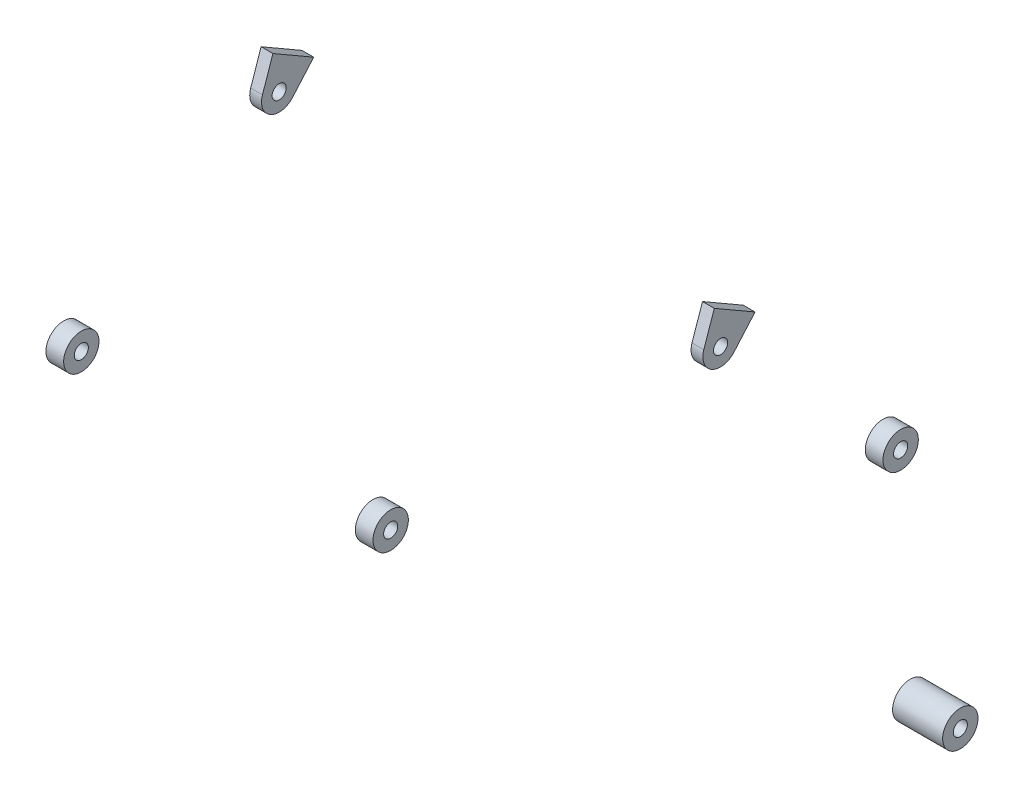
ISO-10303-21;
HEADER;
FILE_DESCRIPTION(('STEP AP214'),'2;1');
FILE_NAME('part.step','',(''),(''),'','','');
FILE_SCHEMA(('AUTOMOTIVE_DESIGN { 1 0 10303 214 1 1 1 1 }'));
ENDSEC;
DATA;
#1=APPLICATION_CONTEXT('core data for automotive mechanical design processes');
#2=APPLICATION_PROTOCOL_DEFINITION('international standard','automotive_design',2000,#1);
#3=PRODUCT_CONTEXT('',#1,'mechanical');
#4=PRODUCT('Part','Part','',(#3));
#5=PRODUCT_RELATED_PRODUCT_CATEGORY('part','',(#4));
#6=PRODUCT_DEFINITION_FORMATION('','',#4);
#7=PRODUCT_DEFINITION_CONTEXT('part definition',#1,'design');
#8=PRODUCT_DEFINITION('design','',#6,#7);
#9=PRODUCT_DEFINITION_SHAPE('','',#8);
#10=(LENGTH_UNIT() NAMED_UNIT(*) SI_UNIT(.MILLI.,.METRE.));
#11=(NAMED_UNIT(*) PLANE_ANGLE_UNIT() SI_UNIT($,.RADIAN.));
#12=(NAMED_UNIT(*) SI_UNIT($,.STERADIAN.) SOLID_ANGLE_UNIT());
#13=UNCERTAINTY_MEASURE_WITH_UNIT(LENGTH_MEASURE(1.E-05),#10,'distance_accuracy_value','');
#14=(GEOMETRIC_REPRESENTATION_CONTEXT(3) GLOBAL_UNCERTAINTY_ASSIGNED_CONTEXT((#13)) GLOBAL_UNIT_ASSIGNED_CONTEXT((#10,
#11,#12)) REPRESENTATION_CONTEXT('',''));
#15=CARTESIAN_POINT('',(0.,0.,0.));
#16=DIRECTION('',(0.,0.,1.));
#17=DIRECTION('',(1.,0.,0.));
#18=AXIS2_PLACEMENT_3D('',#15,#16,#17);
#19=CARTESIAN_POINT('',(-374.5,0.,0.));
#20=DIRECTION('',(-1.,0.,0.));
#21=DIRECTION('',(0.,0.,-1.));
#22=AXIS2_PLACEMENT_3D('',#19,#20,#21);
#23=PLANE('',#22);
#24=DIRECTION('',(0.,-0.946148298154616,0.323733529154957));
#25=VECTOR('',#24,1.);
#26=CARTESIAN_POINT('',(-374.5,4.85600293732436,14.1922244723192));
#27=LINE('',#26,#25);
#28=CARTESIAN_POINT('',(-374.5,30.7846096908265,5.32050807568877));
#29=VERTEX_POINT('',#28);
#30=CARTESIAN_POINT('',(-374.5,4.85600293732436,14.1922244723192));
#31=VERTEX_POINT('',#30);
#32=EDGE_CURVE('E102',#29,#31,#27,.T.);
#33=ORIENTED_EDGE('',*,*,#32,.F.);
#34=DIRECTION('',(0.,0.5,0.866025403784439));
#35=VECTOR('',#34,1.);
#36=CARTESIAN_POINT('',(-374.5,30.7846096908265,5.32050807568877));
#37=LINE('',#36,#35);
#38=CARTESIAN_POINT('',(-374.5,10.7846096908265,-29.3205080756888));
#39=VERTEX_POINT('',#38);
#40=EDGE_CURVE('E105',#39,#29,#37,.T.);
#41=ORIENTED_EDGE('',*,*,#40,.F.);
#42=DIRECTION('',(0.,0.753435609382291,-0.657521697371832));
#43=VECTOR('',#42,1.);
#44=CARTESIAN_POINT('',(-374.5,-9.86282546057748,-11.3015341407344));
#45=LINE('',#44,#43);
#46=CARTESIAN_POINT('',(-374.5,-9.86282546057748,-11.3015341407344));
#47=VERTEX_POINT('',#46);
#48=EDGE_CURVE('E93',#47,#39,#45,.T.);
#49=ORIENTED_EDGE('',*,*,#48,.F.);
#50=CARTESIAN_POINT('',(-374.5,0.,0.));
#51=DIRECTION('',(1.,0.,0.));
#52=DIRECTION('',(0.,0.,-1.));
#53=AXIS2_PLACEMENT_3D('',#50,#51,#52);
#54=CIRCLE('',#53,15.);
#55=EDGE_CURVE('E98',#31,#47,#54,.T.);
#56=ORIENTED_EDGE('',*,*,#55,.F.);
#57=EDGE_LOOP('',(#33,#41,#49,#56));
#58=FACE_BOUND('',#57,.T.);
#59=CARTESIAN_POINT('',(-374.5,0.,0.));
#60=DIRECTION('',(1.,0.,0.));
#61=DIRECTION('',(0.,0.,-1.));
#62=AXIS2_PLACEMENT_3D('',#59,#60,#61);
#63=CIRCLE('',#62,6.);
#64=CARTESIAN_POINT('',(-374.5,0.,-6.));
#65=VERTEX_POINT('',#64);
#66=EDGE_CURVE('E114',#65,#65,#63,.T.);
#67=ORIENTED_EDGE('',*,*,#66,.T.);
#68=EDGE_LOOP('',(#67));
#69=FACE_BOUND('',#68,.T.);
#70=ADVANCED_FACE('F46',(#58,#69),#23,.T.);
#71=CARTESIAN_POINT('',(-364.5,0.,0.));
#72=DIRECTION('',(-1.,0.,0.));
#73=DIRECTION('',(0.,0.,-1.));
#74=AXIS2_PLACEMENT_3D('',#71,#72,#73);
#75=PLANE('',#74);
#76=DIRECTION('',(0.,-0.946148298154616,0.323733529154957));
#77=VECTOR('',#76,1.);
#78=CARTESIAN_POINT('',(-364.5,4.85600293732436,14.1922244723192));
#79=LINE('',#78,#77);
#80=CARTESIAN_POINT('',(-364.5,30.7846096908265,5.32050807568877));
#81=VERTEX_POINT('',#80);
#82=CARTESIAN_POINT('',(-364.5,4.85600293732436,14.1922244723192));
#83=VERTEX_POINT('',#82);
#84=EDGE_CURVE('E110',#81,#83,#79,.T.);
#85=ORIENTED_EDGE('',*,*,#84,.T.);
#86=CARTESIAN_POINT('',(-364.5,0.,0.));
#87=DIRECTION('',(1.,0.,0.));
#88=DIRECTION('',(0.,0.,-1.));
#89=AXIS2_PLACEMENT_3D('',#86,#87,#88);
#90=CIRCLE('',#89,15.);
#91=CARTESIAN_POINT('',(-364.5,-9.86282546057748,-11.3015341407344));
#92=VERTEX_POINT('',#91);
#93=EDGE_CURVE('E113',#83,#92,#90,.T.);
#94=ORIENTED_EDGE('',*,*,#93,.T.);
#95=DIRECTION('',(0.,0.753435609382291,-0.657521697371832));
#96=VECTOR('',#95,1.);
#97=CARTESIAN_POINT('',(-364.5,-9.86282546057748,-11.3015341407344));
#98=LINE('',#97,#96);
#99=CARTESIAN_POINT('',(-364.5,10.7846096908265,-29.3205080756888));
#100=VERTEX_POINT('',#99);
#101=EDGE_CURVE('E96',#92,#100,#98,.T.);
#102=ORIENTED_EDGE('',*,*,#101,.T.);
#103=DIRECTION('',(0.,0.5,0.866025403784439));
#104=VECTOR('',#103,1.);
#105=CARTESIAN_POINT('',(-364.5,30.7846096908265,5.32050807568877));
#106=LINE('',#105,#104);
#107=EDGE_CURVE('E117',#100,#81,#106,.T.);
#108=ORIENTED_EDGE('',*,*,#107,.T.);
#109=EDGE_LOOP('',(#85,#94,#102,#108));
#110=FACE_BOUND('',#109,.T.);
#111=CARTESIAN_POINT('',(-364.5,0.,0.));
#112=DIRECTION('',(1.,0.,0.));
#113=DIRECTION('',(0.,0.,-1.));
#114=AXIS2_PLACEMENT_3D('',#111,#112,#113);
#115=CIRCLE('',#114,6.);
#116=CARTESIAN_POINT('',(-364.5,0.,-6.));
#117=VERTEX_POINT('',#116);
#118=EDGE_CURVE('E122',#117,#117,#115,.T.);
#119=ORIENTED_EDGE('',*,*,#118,.F.);
#120=EDGE_LOOP('',(#119));
#121=FACE_BOUND('',#120,.T.);
#122=ADVANCED_FACE('F135',(#110,#121),#75,.F.);
#123=CARTESIAN_POINT('',(-374.5,4.85600293732436,14.1922244723192));
#124=DIRECTION('',(0.,-0.323733529154957,-0.946148298154616));
#125=DIRECTION('',(0.,0.946148298154616,-0.323733529154957));
#126=AXIS2_PLACEMENT_3D('',#123,#124,#125);
#127=PLANE('',#126);
#128=ORIENTED_EDGE('',*,*,#84,.F.);
#129=DIRECTION('',(1.,0.,0.));
#130=VECTOR('',#129,1.);
#131=CARTESIAN_POINT('',(-374.5,30.7846096908265,5.32050807568877));
#132=LINE('',#131,#130);
#133=EDGE_CURVE('E63',#29,#81,#132,.T.);
#134=ORIENTED_EDGE('',*,*,#133,.F.);
#135=ORIENTED_EDGE('',*,*,#32,.T.);
#136=DIRECTION('',(1.,0.,0.));
#137=VECTOR('',#136,1.);
#138=CARTESIAN_POINT('',(-374.5,4.85600293732436,14.1922244723192));
#139=LINE('',#138,#137);
#140=EDGE_CURVE('E12',#31,#83,#139,.T.);
#141=ORIENTED_EDGE('',*,*,#140,.T.);
#142=EDGE_LOOP('',(#128,#134,#135,#141));
#143=FACE_BOUND('',#142,.T.);
#144=ADVANCED_FACE('F48',(#143),#127,.F.);
#145=CARTESIAN_POINT('',(-374.5,0.,0.));
#146=DIRECTION('',(1.,0.,0.));
#147=DIRECTION('',(0.,0.,1.));
#148=AXIS2_PLACEMENT_3D('',#145,#146,#147);
#149=CYLINDRICAL_SURFACE('',#148,15.);
#150=ORIENTED_EDGE('',*,*,#93,.F.);
#151=ORIENTED_EDGE('',*,*,#140,.F.);
#152=ORIENTED_EDGE('',*,*,#55,.T.);
#153=DIRECTION('',(1.,0.,0.));
#154=VECTOR('',#153,1.);
#155=CARTESIAN_POINT('',(-374.5,-9.86282546057748,-11.3015341407344));
#156=LINE('',#155,#154);
#157=EDGE_CURVE('E55',#47,#92,#156,.T.);
#158=ORIENTED_EDGE('',*,*,#157,.T.);
#159=EDGE_LOOP('',(#150,#151,#152,#158));
#160=FACE_BOUND('',#159,.T.);
#161=ADVANCED_FACE('F99',(#160),#149,.T.);
#162=CARTESIAN_POINT('',(-374.5,-9.86282546057748,-11.3015341407344));
#163=DIRECTION('',(0.,0.657521697371832,0.753435609382291));
#164=DIRECTION('',(0.,-0.753435609382291,0.657521697371832));
#165=AXIS2_PLACEMENT_3D('',#162,#163,#164);
#166=PLANE('',#165);
#167=ORIENTED_EDGE('',*,*,#101,.F.);
#168=ORIENTED_EDGE('',*,*,#157,.F.);
#169=ORIENTED_EDGE('',*,*,#48,.T.);
#170=DIRECTION('',(1.,0.,0.));
#171=VECTOR('',#170,1.);
#172=CARTESIAN_POINT('',(-374.5,10.7846096908265,-29.3205080756888));
#173=LINE('',#172,#171);
#174=EDGE_CURVE('E79',#39,#100,#173,.T.);
#175=ORIENTED_EDGE('',*,*,#174,.T.);
#176=EDGE_LOOP('',(#167,#168,#169,#175));
#177=FACE_BOUND('',#176,.T.);
#178=ADVANCED_FACE('F91',(#177),#166,.F.);
#179=CARTESIAN_POINT('',(-374.5,30.7846096908265,5.32050807568877));
#180=DIRECTION('',(0.,-0.866025403784439,0.5));
#181=DIRECTION('',(0.,-0.5,-0.866025403784439));
#182=AXIS2_PLACEMENT_3D('',#179,#180,#181);
#183=PLANE('',#182);
#184=ORIENTED_EDGE('',*,*,#107,.F.);
#185=ORIENTED_EDGE('',*,*,#174,.F.);
#186=ORIENTED_EDGE('',*,*,#40,.T.);
#187=ORIENTED_EDGE('',*,*,#133,.T.);
#188=EDGE_LOOP('',(#184,#185,#186,#187));
#189=FACE_BOUND('',#188,.T.);
#190=ADVANCED_FACE('F131',(#189),#183,.F.);
#191=CARTESIAN_POINT('',(-374.5,0.,0.));
#192=DIRECTION('',(1.,0.,0.));
#193=DIRECTION('',(0.,0.,1.));
#194=AXIS2_PLACEMENT_3D('',#191,#192,#193);
#195=CYLINDRICAL_SURFACE('',#194,6.);
#196=ORIENTED_EDGE('',*,*,#66,.F.);
#197=EDGE_LOOP('',(#196));
#198=FACE_BOUND('',#197,.T.);
#199=ORIENTED_EDGE('',*,*,#118,.T.);
#200=EDGE_LOOP('',(#199));
#201=FACE_BOUND('',#200,.T.);
#202=ADVANCED_FACE('F128',(#198,#201),#195,.F.);
#203=CLOSED_SHELL('',(#70,#122,#144,#161,#178,#190,#202));
#204=MANIFOLD_SOLID_BREP('B2',#203);
#205=CARTESIAN_POINT('',(-306.,-48.3944880943371,226.385122130601));
#206=DIRECTION('',(-1.,0.,0.));
#207=DIRECTION('',(0.,0.,-1.));
#208=AXIS2_PLACEMENT_3D('',#205,#206,#207);
#209=CYLINDRICAL_SURFACE('',#208,15.);
#210=CARTESIAN_POINT('',(-306.,-48.3944880943371,226.385122130601));
#211=DIRECTION('',(1.,0.,0.));
#212=DIRECTION('',(0.,0.,-1.));
#213=AXIS2_PLACEMENT_3D('',#210,#211,#212);
#214=CIRCLE('',#213,15.);
#215=CARTESIAN_POINT('',(-306.,-48.3944880943371,211.385122130601));
#216=VERTEX_POINT('',#215);
#217=EDGE_CURVE('E45',#216,#216,#214,.T.);
#218=ORIENTED_EDGE('',*,*,#217,.F.);
#219=EDGE_LOOP('',(#218));
#220=FACE_BOUND('',#219,.T.);
#221=CARTESIAN_POINT('',(-321.,-48.3944880943371,226.385122130601));
#222=DIRECTION('',(1.,0.,0.));
#223=DIRECTION('',(0.,0.,-1.));
#224=AXIS2_PLACEMENT_3D('',#221,#222,#223);
#225=CIRCLE('',#224,15.);
#226=CARTESIAN_POINT('',(-321.,-48.3944880943371,211.385122130601));
#227=VERTEX_POINT('',#226);
#228=EDGE_CURVE('E202',#227,#227,#225,.T.);
#229=ORIENTED_EDGE('',*,*,#228,.T.);
#230=EDGE_LOOP('',(#229));
#231=FACE_BOUND('',#230,.T.);
#232=ADVANCED_FACE('F199',(#220,#231),#209,.T.);
#233=CARTESIAN_POINT('',(-306.,-48.3944880943371,226.385122130601));
#234=DIRECTION('',(-1.,0.,0.));
#235=DIRECTION('',(0.,0.,-1.));
#236=AXIS2_PLACEMENT_3D('',#233,#234,#235);
#237=PLANE('',#236);
#238=CARTESIAN_POINT('',(-306.,-48.3944880943371,226.385122130601));
#239=DIRECTION('',(1.,0.,0.));
#240=DIRECTION('',(0.,0.,-1.));
#241=AXIS2_PLACEMENT_3D('',#238,#239,#240);
#242=CIRCLE('',#241,6.00000000000002);
#243=CARTESIAN_POINT('',(-306.,-48.3944880943371,220.385122130601));
#244=VERTEX_POINT('',#243);
#245=EDGE_CURVE('E209',#244,#244,#242,.T.);
#246=ORIENTED_EDGE('',*,*,#245,.F.);
#247=EDGE_LOOP('',(#246));
#248=FACE_BOUND('',#247,.T.);
#249=ORIENTED_EDGE('',*,*,#217,.T.);
#250=EDGE_LOOP('',(#249));
#251=FACE_BOUND('',#250,.T.);
#252=ADVANCED_FACE('F220',(#248,#251),#237,.F.);
#253=CARTESIAN_POINT('',(-321.,-48.3944880943371,226.385122130601));
#254=DIRECTION('',(-1.,0.,0.));
#255=DIRECTION('',(0.,0.,-1.));
#256=AXIS2_PLACEMENT_3D('',#253,#254,#255);
#257=PLANE('',#256);
#258=CARTESIAN_POINT('',(-321.,-48.3944880943371,226.385122130601));
#259=DIRECTION('',(1.,0.,0.));
#260=DIRECTION('',(0.,0.,-1.));
#261=AXIS2_PLACEMENT_3D('',#258,#259,#260);
#262=CIRCLE('',#261,6.00000000000002);
#263=CARTESIAN_POINT('',(-321.,-48.3944880943371,220.385122130601));
#264=VERTEX_POINT('',#263);
#265=EDGE_CURVE('E211',#264,#264,#262,.T.);
#266=ORIENTED_EDGE('',*,*,#265,.T.);
#267=EDGE_LOOP('',(#266));
#268=FACE_BOUND('',#267,.T.);
#269=ORIENTED_EDGE('',*,*,#228,.F.);
#270=EDGE_LOOP('',(#269));
#271=FACE_BOUND('',#270,.T.);
#272=ADVANCED_FACE('F222',(#268,#271),#257,.T.);
#273=CARTESIAN_POINT('',(-306.,-48.3944880943371,226.385122130601));
#274=DIRECTION('',(-1.,0.,0.));
#275=DIRECTION('',(0.,0.,-1.));
#276=AXIS2_PLACEMENT_3D('',#273,#274,#275);
#277=CYLINDRICAL_SURFACE('',#276,6.00000000000002);
#278=ORIENTED_EDGE('',*,*,#245,.T.);
#279=EDGE_LOOP('',(#278));
#280=FACE_BOUND('',#279,.T.);
#281=ORIENTED_EDGE('',*,*,#265,.F.);
#282=EDGE_LOOP('',(#281));
#283=FACE_BOUND('',#282,.T.);
#284=ADVANCED_FACE('F217',(#280,#283),#277,.F.);
#285=CLOSED_SHELL('',(#232,#252,#272,#284));
#286=MANIFOLD_SOLID_BREP('B6',#285);
#287=CARTESIAN_POINT('',(-36.5,-198.760014478319,-199.340679853808));
#288=DIRECTION('',(-1.,0.,0.));
#289=DIRECTION('',(0.,0.,1.));
#290=AXIS2_PLACEMENT_3D('',#287,#288,#289);
#291=CYLINDRICAL_SURFACE('',#290,15.);
#292=CARTESIAN_POINT('',(-36.5,-198.760014478319,-199.340679853808));
#293=DIRECTION('',(1.,0.,0.));
#294=DIRECTION('',(0.,0.,-1.));
#295=AXIS2_PLACEMENT_3D('',#292,#293,#294);
#296=CIRCLE('',#295,15.);
#297=CARTESIAN_POINT('',(-36.5,-198.760014478319,-214.340679853808));
#298=VERTEX_POINT('',#297);
#299=EDGE_CURVE('E276',#298,#298,#296,.T.);
#300=ORIENTED_EDGE('',*,*,#299,.F.);
#301=EDGE_LOOP('',(#300));
#302=FACE_BOUND('',#301,.T.);
#303=CARTESIAN_POINT('',(-51.5,-198.760014478319,-199.340679853808));
#304=DIRECTION('',(1.,0.,0.));
#305=DIRECTION('',(0.,0.,-1.));
#306=AXIS2_PLACEMENT_3D('',#303,#304,#305);
#307=CIRCLE('',#306,15.);
#308=CARTESIAN_POINT('',(-51.5,-198.760014478319,-214.340679853808));
#309=VERTEX_POINT('',#308);
#310=EDGE_CURVE('E282',#309,#309,#307,.T.);
#311=ORIENTED_EDGE('',*,*,#310,.T.);
#312=EDGE_LOOP('',(#311));
#313=FACE_BOUND('',#312,.T.);
#314=ADVANCED_FACE('F269',(#302,#313),#291,.T.);
#315=CARTESIAN_POINT('',(-36.5,-198.760014478319,-199.340679853808));
#316=DIRECTION('',(-1.,0.,0.));
#317=DIRECTION('',(0.,0.,1.));
#318=AXIS2_PLACEMENT_3D('',#315,#316,#317);
#319=CYLINDRICAL_SURFACE('',#318,6.00000000000002);
#320=CARTESIAN_POINT('',(-36.5,-198.760014478319,-199.340679853808));
#321=DIRECTION('',(1.,0.,0.));
#322=DIRECTION('',(0.,0.,-1.));
#323=AXIS2_PLACEMENT_3D('',#320,#321,#322);
#324=CIRCLE('',#323,6.00000000000002);
#325=CARTESIAN_POINT('',(-36.5,-198.760014478319,-205.340679853808));
#326=VERTEX_POINT('',#325);
#327=EDGE_CURVE('E198',#326,#326,#324,.T.);
#328=ORIENTED_EDGE('',*,*,#327,.T.);
#329=EDGE_LOOP('',(#328));
#330=FACE_BOUND('',#329,.T.);
#331=CARTESIAN_POINT('',(-51.5,-198.760014478319,-199.340679853808));
#332=DIRECTION('',(1.,0.,0.));
#333=DIRECTION('',(0.,0.,-1.));
#334=AXIS2_PLACEMENT_3D('',#331,#332,#333);
#335=CIRCLE('',#334,6.00000000000002);
#336=CARTESIAN_POINT('',(-51.5,-198.760014478319,-205.340679853808));
#337=VERTEX_POINT('',#336);
#338=EDGE_CURVE('E272',#337,#337,#335,.T.);
#339=ORIENTED_EDGE('',*,*,#338,.F.);
#340=EDGE_LOOP('',(#339));
#341=FACE_BOUND('',#340,.T.);
#342=ADVANCED_FACE('F291',(#330,#341),#319,.F.);
#343=CARTESIAN_POINT('',(-36.5,0.,0.));
#344=DIRECTION('',(1.,0.,0.));
#345=DIRECTION('',(0.,0.,-1.));
#346=AXIS2_PLACEMENT_3D('',#343,#344,#345);
#347=PLANE('',#346);
#348=ORIENTED_EDGE('',*,*,#299,.T.);
#349=EDGE_LOOP('',(#348));
#350=FACE_BOUND('',#349,.T.);
#351=ORIENTED_EDGE('',*,*,#327,.F.);
#352=EDGE_LOOP('',(#351));
#353=FACE_BOUND('',#352,.T.);
#354=ADVANCED_FACE('F293',(#350,#353),#347,.T.);
#355=CARTESIAN_POINT('',(-51.5,0.,0.));
#356=DIRECTION('',(1.,0.,0.));
#357=DIRECTION('',(0.,0.,-1.));
#358=AXIS2_PLACEMENT_3D('',#355,#356,#357);
#359=PLANE('',#358);
#360=ORIENTED_EDGE('',*,*,#310,.F.);
#361=EDGE_LOOP('',(#360));
#362=FACE_BOUND('',#361,.T.);
#363=ORIENTED_EDGE('',*,*,#338,.T.);
#364=EDGE_LOOP('',(#363));
#365=FACE_BOUND('',#364,.T.);
#366=ADVANCED_FACE('F289',(#362,#365),#359,.F.);
#367=CLOSED_SHELL('',(#314,#342,#354,#366));
#368=MANIFOLD_SOLID_BREP('B40',#367);
#369=CARTESIAN_POINT('',(-30.,-422.357745707924,-243.457119430366));
#370=DIRECTION('',(1.,0.,0.));
#371=DIRECTION('',(0.,0.,-1.));
#372=AXIS2_PLACEMENT_3D('',#369,#370,#371);
#373=PLANE('',#372);
#374=CARTESIAN_POINT('',(-30.,-422.357745707924,-243.457119430366));
#375=DIRECTION('',(1.,0.,0.));
#376=DIRECTION('',(0.,0.,-1.));
#377=AXIS2_PLACEMENT_3D('',#374,#375,#376);
#378=CIRCLE('',#377,15.0000000000001);
#379=CARTESIAN_POINT('',(-30.,-422.357745707924,-258.457119430366));
#380=VERTEX_POINT('',#379);
#381=EDGE_CURVE('E268',#380,#380,#378,.T.);
#382=ORIENTED_EDGE('',*,*,#381,.T.);
#383=EDGE_LOOP('',(#382));
#384=FACE_BOUND('',#383,.T.);
#385=CARTESIAN_POINT('',(-30.,-422.357745707924,-243.457119430366));
#386=DIRECTION('',(1.,0.,0.));
#387=DIRECTION('',(0.,0.,-1.));
#388=AXIS2_PLACEMENT_3D('',#385,#386,#387);
#389=CIRCLE('',#388,5.99999999999999);
#390=CARTESIAN_POINT('',(-30.,-422.357745707924,-249.457119430366));
#391=VERTEX_POINT('',#390);
#392=EDGE_CURVE('E362',#391,#391,#389,.T.);
#393=ORIENTED_EDGE('',*,*,#392,.F.);
#394=EDGE_LOOP('',(#393));
#395=FACE_BOUND('',#394,.T.);
#396=ADVANCED_FACE('F351',(#384,#395),#373,.T.);
#397=CARTESIAN_POINT('',(-72.5,-422.357745707924,-243.457119430366));
#398=DIRECTION('',(1.,0.,0.));
#399=DIRECTION('',(0.,0.,-1.));
#400=AXIS2_PLACEMENT_3D('',#397,#398,#399);
#401=PLANE('',#400);
#402=CARTESIAN_POINT('',(-72.5,-422.357745707924,-243.457119430366));
#403=DIRECTION('',(1.,0.,0.));
#404=DIRECTION('',(0.,0.,-1.));
#405=AXIS2_PLACEMENT_3D('',#402,#403,#404);
#406=CIRCLE('',#405,15.0000000000001);
#407=CARTESIAN_POINT('',(-72.5,-422.357745707924,-258.457119430366));
#408=VERTEX_POINT('',#407);
#409=EDGE_CURVE('E355',#408,#408,#406,.T.);
#410=ORIENTED_EDGE('',*,*,#409,.F.);
#411=EDGE_LOOP('',(#410));
#412=FACE_BOUND('',#411,.T.);
#413=CARTESIAN_POINT('',(-72.5,-422.357745707924,-243.457119430366));
#414=DIRECTION('',(1.,0.,0.));
#415=DIRECTION('',(0.,0.,-1.));
#416=AXIS2_PLACEMENT_3D('',#413,#414,#415);
#417=CIRCLE('',#416,5.99999999999999);
#418=CARTESIAN_POINT('',(-72.5,-422.357745707924,-249.457119430366));
#419=VERTEX_POINT('',#418);
#420=EDGE_CURVE('E364',#419,#419,#417,.T.);
#421=ORIENTED_EDGE('',*,*,#420,.T.);
#422=EDGE_LOOP('',(#421));
#423=FACE_BOUND('',#422,.T.);
#424=ADVANCED_FACE('F374',(#412,#423),#401,.F.);
#425=CARTESIAN_POINT('',(-30.,-422.357745707924,-243.457119430366));
#426=DIRECTION('',(-1.,0.,0.));
#427=DIRECTION('',(0.,0.,1.));
#428=AXIS2_PLACEMENT_3D('',#425,#426,#427);
#429=CYLINDRICAL_SURFACE('',#428,15.0000000000001);
#430=ORIENTED_EDGE('',*,*,#381,.F.);
#431=EDGE_LOOP('',(#430));
#432=FACE_BOUND('',#431,.T.);
#433=ORIENTED_EDGE('',*,*,#409,.T.);
#434=EDGE_LOOP('',(#433));
#435=FACE_BOUND('',#434,.T.);
#436=ADVANCED_FACE('F353',(#432,#435),#429,.T.);
#437=CARTESIAN_POINT('',(-30.,-422.357745707924,-243.457119430366));
#438=DIRECTION('',(-1.,0.,0.));
#439=DIRECTION('',(0.,0.,1.));
#440=AXIS2_PLACEMENT_3D('',#437,#438,#439);
#441=CYLINDRICAL_SURFACE('',#440,5.99999999999999);
#442=ORIENTED_EDGE('',*,*,#392,.T.);
#443=EDGE_LOOP('',(#442));
#444=FACE_BOUND('',#443,.T.);
#445=ORIENTED_EDGE('',*,*,#420,.F.);
#446=EDGE_LOOP('',(#445));
#447=FACE_BOUND('',#446,.T.);
#448=ADVANCED_FACE('F370',(#444,#447),#441,.F.);
#449=CLOSED_SHELL('',(#396,#424,#436,#448));
#450=MANIFOLD_SOLID_BREP('B193',#449);
#451=CARTESIAN_POINT('',(-58.5,-48.3944880943371,226.385122130601));
#452=DIRECTION('',(1.,0.,0.));
#453=DIRECTION('',(0.,0.,-1.));
#454=AXIS2_PLACEMENT_3D('',#451,#452,#453);
#455=CYLINDRICAL_SURFACE('',#454,15.);
#456=CARTESIAN_POINT('',(-58.5,-48.3944880943371,226.385122130601));
#457=DIRECTION('',(1.,0.,0.));
#458=DIRECTION('',(0.,0.,-1.));
#459=AXIS2_PLACEMENT_3D('',#456,#457,#458);
#460=CIRCLE('',#459,15.);
#461=CARTESIAN_POINT('',(-58.5,-48.3944880943371,211.385122130601));
#462=VERTEX_POINT('',#461);
#463=EDGE_CURVE('E350',#462,#462,#460,.T.);
#464=ORIENTED_EDGE('',*,*,#463,.T.);
#465=EDGE_LOOP('',(#464));
#466=FACE_BOUND('',#465,.T.);
#467=CARTESIAN_POINT('',(-43.5,-48.3944880943371,226.385122130601));
#468=DIRECTION('',(1.,0.,0.));
#469=DIRECTION('',(0.,0.,-1.));
#470=AXIS2_PLACEMENT_3D('',#467,#468,#469);
#471=CIRCLE('',#470,15.);
#472=CARTESIAN_POINT('',(-43.5,-48.3944880943371,211.385122130601));
#473=VERTEX_POINT('',#472);
#474=EDGE_CURVE('E425',#473,#473,#471,.T.);
#475=ORIENTED_EDGE('',*,*,#474,.F.);
#476=EDGE_LOOP('',(#475));
#477=FACE_BOUND('',#476,.T.);
#478=ADVANCED_FACE('F422',(#466,#477),#455,.T.);
#479=CARTESIAN_POINT('',(-58.5,-48.3944880943371,226.385122130601));
#480=DIRECTION('',(1.,0.,0.));
#481=DIRECTION('',(0.,0.,-1.));
#482=AXIS2_PLACEMENT_3D('',#479,#480,#481);
#483=PLANE('',#482);
#484=CARTESIAN_POINT('',(-58.5,-48.3944880943371,226.385122130601));
#485=DIRECTION('',(1.,0.,0.));
#486=DIRECTION('',(0.,0.,-1.));
#487=AXIS2_PLACEMENT_3D('',#484,#485,#486);
#488=CIRCLE('',#487,6.00000000000002);
#489=CARTESIAN_POINT('',(-58.5,-48.3944880943371,220.385122130601));
#490=VERTEX_POINT('',#489);
#491=EDGE_CURVE('E432',#490,#490,#488,.T.);
#492=ORIENTED_EDGE('',*,*,#491,.T.);
#493=EDGE_LOOP('',(#492));
#494=FACE_BOUND('',#493,.T.);
#495=ORIENTED_EDGE('',*,*,#463,.F.);
#496=EDGE_LOOP('',(#495));
#497=FACE_BOUND('',#496,.T.);
#498=ADVANCED_FACE('F440',(#494,#497),#483,.F.);
#499=CARTESIAN_POINT('',(-43.5,-48.3944880943371,226.385122130601));
#500=DIRECTION('',(1.,0.,0.));
#501=DIRECTION('',(0.,0.,-1.));
#502=AXIS2_PLACEMENT_3D('',#499,#500,#501);
#503=PLANE('',#502);
#504=CARTESIAN_POINT('',(-43.5,-48.3944880943371,226.385122130601));
#505=DIRECTION('',(1.,0.,0.));
#506=DIRECTION('',(0.,0.,-1.));
#507=AXIS2_PLACEMENT_3D('',#504,#505,#506);
#508=CIRCLE('',#507,6.00000000000002);
#509=CARTESIAN_POINT('',(-43.5,-48.3944880943371,220.385122130601));
#510=VERTEX_POINT('',#509);
#511=EDGE_CURVE('E434',#510,#510,#508,.T.);
#512=ORIENTED_EDGE('',*,*,#511,.F.);
#513=EDGE_LOOP('',(#512));
#514=FACE_BOUND('',#513,.T.);
#515=ORIENTED_EDGE('',*,*,#474,.T.);
#516=EDGE_LOOP('',(#515));
#517=FACE_BOUND('',#516,.T.);
#518=ADVANCED_FACE('F446',(#514,#517),#503,.T.);
#519=CARTESIAN_POINT('',(-58.5,-48.3944880943371,226.385122130601));
#520=DIRECTION('',(1.,0.,0.));
#521=DIRECTION('',(0.,0.,-1.));
#522=AXIS2_PLACEMENT_3D('',#519,#520,#521);
#523=CYLINDRICAL_SURFACE('',#522,6.00000000000002);
#524=ORIENTED_EDGE('',*,*,#491,.F.);
#525=EDGE_LOOP('',(#524));
#526=FACE_BOUND('',#525,.T.);
#527=ORIENTED_EDGE('',*,*,#511,.T.);
#528=EDGE_LOOP('',(#527));
#529=FACE_BOUND('',#528,.T.);
#530=ADVANCED_FACE('F443',(#526,#529),#523,.F.);
#531=CLOSED_SHELL('',(#478,#498,#518,#530));
#532=MANIFOLD_SOLID_BREP('B263',#531);
#533=CARTESIAN_POINT('',(10.,0.,0.));
#534=DIRECTION('',(1.,0.,0.));
#535=DIRECTION('',(0.,0.,-1.));
#536=AXIS2_PLACEMENT_3D('',#533,#534,#535);
#537=PLANE('',#536);
#538=DIRECTION('',(0.,-0.946148298154616,0.323733529154957));
#539=VECTOR('',#538,1.);
#540=CARTESIAN_POINT('',(10.,4.85600293732436,14.1922244723192));
#541=LINE('',#540,#539);
#542=CARTESIAN_POINT('',(10.,30.7846096908265,5.32050807568877));
#543=VERTEX_POINT('',#542);
#544=CARTESIAN_POINT('',(10.,4.85600293732436,14.1922244723192));
#545=VERTEX_POINT('',#544);
#546=EDGE_CURVE('E536',#543,#545,#541,.T.);
#547=ORIENTED_EDGE('',*,*,#546,.T.);
#548=CARTESIAN_POINT('',(10.,0.,0.));
#549=DIRECTION('',(1.,0.,0.));
#550=DIRECTION('',(0.,0.,-1.));
#551=AXIS2_PLACEMENT_3D('',#548,#549,#550);
#552=CIRCLE('',#551,15.);
#553=CARTESIAN_POINT('',(10.,-9.86282546057748,-11.3015341407344));
#554=VERTEX_POINT('',#553);
#555=EDGE_CURVE('E531',#545,#554,#552,.T.);
#556=ORIENTED_EDGE('',*,*,#555,.T.);
#557=DIRECTION('',(0.,0.753435609382291,-0.657521697371832));
#558=VECTOR('',#557,1.);
#559=CARTESIAN_POINT('',(10.,-9.86282546057748,-11.3015341407344));
#560=LINE('',#559,#558);
#561=CARTESIAN_POINT('',(10.,10.7846096908265,-29.3205080756888));
#562=VERTEX_POINT('',#561);
#563=EDGE_CURVE('E534',#554,#562,#560,.T.);
#564=ORIENTED_EDGE('',*,*,#563,.T.);
#565=DIRECTION('',(0.,0.5,0.866025403784439));
#566=VECTOR('',#565,1.);
#567=CARTESIAN_POINT('',(10.,30.7846096908265,5.32050807568877));
#568=LINE('',#567,#566);
#569=EDGE_CURVE('E501',#562,#543,#568,.T.);
#570=ORIENTED_EDGE('',*,*,#569,.T.);
#571=EDGE_LOOP('',(#547,#556,#564,#570));
#572=FACE_BOUND('',#571,.T.);
#573=CARTESIAN_POINT('',(10.,0.,0.));
#574=DIRECTION('',(1.,0.,0.));
#575=DIRECTION('',(0.,0.,-1.));
#576=AXIS2_PLACEMENT_3D('',#573,#574,#575);
#577=CIRCLE('',#576,6.);
#578=CARTESIAN_POINT('',(10.,0.,-6.));
#579=VERTEX_POINT('',#578);
#580=EDGE_CURVE('E551',#579,#579,#577,.T.);
#581=ORIENTED_EDGE('',*,*,#580,.F.);
#582=EDGE_LOOP('',(#581));
#583=FACE_BOUND('',#582,.T.);
#584=ADVANCED_FACE('F484',(#572,#583),#537,.T.);
#585=CARTESIAN_POINT('',(0.,0.,0.));
#586=DIRECTION('',(1.,0.,0.));
#587=DIRECTION('',(0.,0.,-1.));
#588=AXIS2_PLACEMENT_3D('',#585,#586,#587);
#589=PLANE('',#588);
#590=DIRECTION('',(0.,-0.946148298154616,0.323733529154957));
#591=VECTOR('',#590,1.);
#592=CARTESIAN_POINT('',(0.,4.85600293732436,14.1922244723192));
#593=LINE('',#592,#591);
#594=CARTESIAN_POINT('',(0.,30.7846096908265,5.32050807568877));
#595=VERTEX_POINT('',#594);
#596=CARTESIAN_POINT('',(0.,4.85600293732436,14.1922244723192));
#597=VERTEX_POINT('',#596);
#598=EDGE_CURVE('E548',#595,#597,#593,.T.);
#599=ORIENTED_EDGE('',*,*,#598,.F.);
#600=DIRECTION('',(0.,0.5,0.866025403784439));
#601=VECTOR('',#600,1.);
#602=CARTESIAN_POINT('',(0.,30.7846096908265,5.32050807568877));
#603=LINE('',#602,#601);
#604=CARTESIAN_POINT('',(0.,10.7846096908265,-29.3205080756888));
#605=VERTEX_POINT('',#604);
#606=EDGE_CURVE('E524',#605,#595,#603,.T.);
#607=ORIENTED_EDGE('',*,*,#606,.F.);
#608=DIRECTION('',(0.,0.753435609382291,-0.657521697371832));
#609=VECTOR('',#608,1.);
#610=CARTESIAN_POINT('',(0.,-9.86282546057748,-11.3015341407344));
#611=LINE('',#610,#609);
#612=CARTESIAN_POINT('',(0.,-9.86282546057748,-11.3015341407344));
#613=VERTEX_POINT('',#612);
#614=EDGE_CURVE('E518',#613,#605,#611,.T.);
#615=ORIENTED_EDGE('',*,*,#614,.F.);
#616=CARTESIAN_POINT('',(0.,0.,0.));
#617=DIRECTION('',(1.,0.,0.));
#618=DIRECTION('',(0.,0.,-1.));
#619=AXIS2_PLACEMENT_3D('',#616,#617,#618);
#620=CIRCLE('',#619,15.);
#621=EDGE_CURVE('E540',#597,#613,#620,.T.);
#622=ORIENTED_EDGE('',*,*,#621,.F.);
#623=EDGE_LOOP('',(#599,#607,#615,#622));
#624=FACE_BOUND('',#623,.T.);
#625=CARTESIAN_POINT('',(0.,0.,0.));
#626=DIRECTION('',(1.,0.,0.));
#627=DIRECTION('',(0.,0.,-1.));
#628=AXIS2_PLACEMENT_3D('',#625,#626,#627);
#629=CIRCLE('',#628,6.);
#630=CARTESIAN_POINT('',(0.,0.,-6.));
#631=VERTEX_POINT('',#630);
#632=EDGE_CURVE('E563',#631,#631,#629,.T.);
#633=ORIENTED_EDGE('',*,*,#632,.T.);
#634=EDGE_LOOP('',(#633));
#635=FACE_BOUND('',#634,.T.);
#636=ADVANCED_FACE('F559',(#624,#635),#589,.F.);
#637=CARTESIAN_POINT('',(10.,4.85600293732436,14.1922244723192));
#638=DIRECTION('',(0.,-0.323733529154957,-0.946148298154616));
#639=DIRECTION('',(0.,0.946148298154616,-0.323733529154957));
#640=AXIS2_PLACEMENT_3D('',#637,#638,#639);
#641=PLANE('',#640);
#642=ORIENTED_EDGE('',*,*,#598,.T.);
#643=DIRECTION('',(-1.,0.,0.));
#644=VECTOR('',#643,1.);
#645=CARTESIAN_POINT('',(10.,4.85600293732436,14.1922244723192));
#646=LINE('',#645,#644);
#647=EDGE_CURVE('E420',#545,#597,#646,.T.);
#648=ORIENTED_EDGE('',*,*,#647,.F.);
#649=ORIENTED_EDGE('',*,*,#546,.F.);
#650=DIRECTION('',(-1.,0.,0.));
#651=VECTOR('',#650,1.);
#652=CARTESIAN_POINT('',(10.,30.7846096908265,5.32050807568877));
#653=LINE('',#652,#651);
#654=EDGE_CURVE('E544',#543,#595,#653,.T.);
#655=ORIENTED_EDGE('',*,*,#654,.T.);
#656=EDGE_LOOP('',(#642,#648,#649,#655));
#657=FACE_BOUND('',#656,.T.);
#658=ADVANCED_FACE('F486',(#657),#641,.F.);
#659=CARTESIAN_POINT('',(10.,0.,0.));
#660=DIRECTION('',(-1.,0.,0.));
#661=DIRECTION('',(0.,0.,1.));
#662=AXIS2_PLACEMENT_3D('',#659,#660,#661);
#663=CYLINDRICAL_SURFACE('',#662,15.);
#664=ORIENTED_EDGE('',*,*,#621,.T.);
#665=DIRECTION('',(-1.,0.,0.));
#666=VECTOR('',#665,1.);
#667=CARTESIAN_POINT('',(10.,-9.86282546057748,-11.3015341407344));
#668=LINE('',#667,#666);
#669=EDGE_CURVE('E493',#554,#613,#668,.T.);
#670=ORIENTED_EDGE('',*,*,#669,.F.);
#671=ORIENTED_EDGE('',*,*,#555,.F.);
#672=ORIENTED_EDGE('',*,*,#647,.T.);
#673=EDGE_LOOP('',(#664,#670,#671,#672));
#674=FACE_BOUND('',#673,.T.);
#675=ADVANCED_FACE('F539',(#674),#663,.T.);
#676=CARTESIAN_POINT('',(10.,-9.86282546057748,-11.3015341407344));
#677=DIRECTION('',(0.,0.657521697371832,0.753435609382291));
#678=DIRECTION('',(0.,-0.753435609382291,0.657521697371832));
#679=AXIS2_PLACEMENT_3D('',#676,#677,#678);
#680=PLANE('',#679);
#681=ORIENTED_EDGE('',*,*,#614,.T.);
#682=DIRECTION('',(-1.,0.,0.));
#683=VECTOR('',#682,1.);
#684=CARTESIAN_POINT('',(10.,10.7846096908265,-29.3205080756888));
#685=LINE('',#684,#683);
#686=EDGE_CURVE('E541',#562,#605,#685,.T.);
#687=ORIENTED_EDGE('',*,*,#686,.F.);
#688=ORIENTED_EDGE('',*,*,#563,.F.);
#689=ORIENTED_EDGE('',*,*,#669,.T.);
#690=EDGE_LOOP('',(#681,#687,#688,#689));
#691=FACE_BOUND('',#690,.T.);
#692=ADVANCED_FACE('F542',(#691),#680,.F.);
#693=CARTESIAN_POINT('',(10.,30.7846096908265,5.32050807568877));
#694=DIRECTION('',(0.,-0.866025403784439,0.5));
#695=DIRECTION('',(0.,-0.5,-0.866025403784439));
#696=AXIS2_PLACEMENT_3D('',#693,#694,#695);
#697=PLANE('',#696);
#698=ORIENTED_EDGE('',*,*,#606,.T.);
#699=ORIENTED_EDGE('',*,*,#654,.F.);
#700=ORIENTED_EDGE('',*,*,#569,.F.);
#701=ORIENTED_EDGE('',*,*,#686,.T.);
#702=EDGE_LOOP('',(#698,#699,#700,#701));
#703=FACE_BOUND('',#702,.T.);
#704=ADVANCED_FACE('F556',(#703),#697,.F.);
#705=CARTESIAN_POINT('',(10.,0.,0.));
#706=DIRECTION('',(-1.,0.,0.));
#707=DIRECTION('',(0.,0.,1.));
#708=AXIS2_PLACEMENT_3D('',#705,#706,#707);
#709=CYLINDRICAL_SURFACE('',#708,6.);
#710=ORIENTED_EDGE('',*,*,#580,.T.);
#711=EDGE_LOOP('',(#710));
#712=FACE_BOUND('',#711,.T.);
#713=ORIENTED_EDGE('',*,*,#632,.F.);
#714=EDGE_LOOP('',(#713));
#715=FACE_BOUND('',#714,.T.);
#716=ADVANCED_FACE('F569',(#712,#715),#709,.F.);
#717=CLOSED_SHELL('',(#584,#636,#658,#675,#692,#704,#716));
#718=MANIFOLD_SOLID_BREP('B345',#717);
#719=ADVANCED_BREP_SHAPE_REPRESENTATION('',(#18,#204,#286,#368,#450,#532,#718),#14);
#720=SHAPE_DEFINITION_REPRESENTATION(#9,#719);
ENDSEC;
END-ISO-10303-21;
